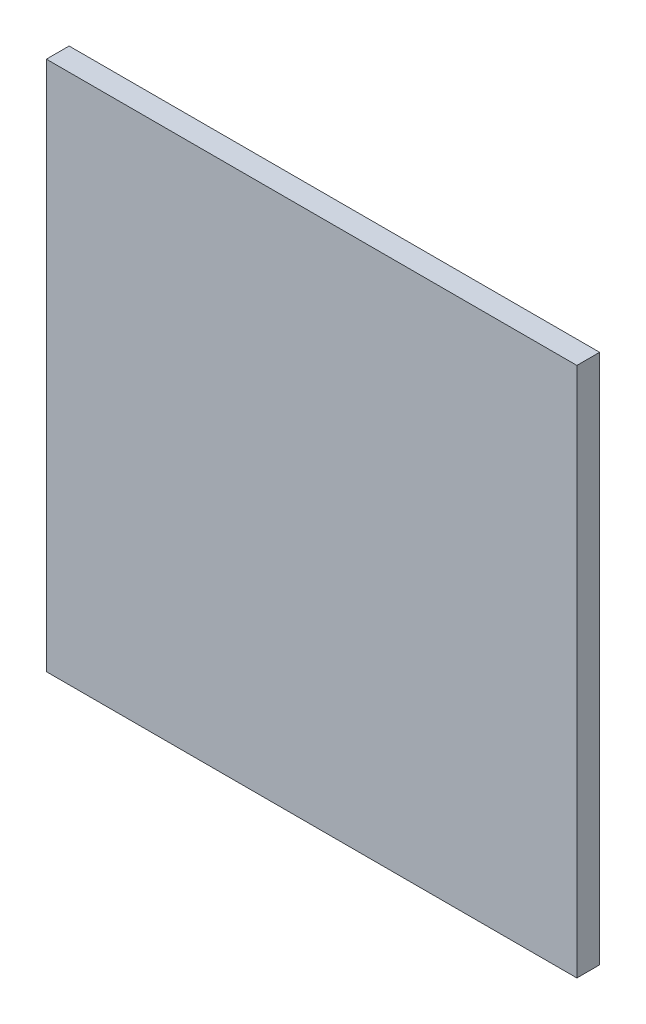
ISO-10303-21;
HEADER;
FILE_DESCRIPTION(('STEP AP214'),'2;1');
FILE_NAME('part.step','',(''),(''),'','','');
FILE_SCHEMA(('AUTOMOTIVE_DESIGN { 1 0 10303 214 1 1 1 1 }'));
ENDSEC;
DATA;
#1=APPLICATION_CONTEXT('core data for automotive mechanical design processes');
#2=APPLICATION_PROTOCOL_DEFINITION('international standard','automotive_design',2000,#1);
#3=PRODUCT_CONTEXT('',#1,'mechanical');
#4=PRODUCT('Part','Part','',(#3));
#5=PRODUCT_RELATED_PRODUCT_CATEGORY('part','',(#4));
#6=PRODUCT_DEFINITION_FORMATION('','',#4);
#7=PRODUCT_DEFINITION_CONTEXT('part definition',#1,'design');
#8=PRODUCT_DEFINITION('design','',#6,#7);
#9=PRODUCT_DEFINITION_SHAPE('','',#8);
#10=(LENGTH_UNIT() NAMED_UNIT(*) SI_UNIT(.MILLI.,.METRE.));
#11=(NAMED_UNIT(*) PLANE_ANGLE_UNIT() SI_UNIT($,.RADIAN.));
#12=(NAMED_UNIT(*) SI_UNIT($,.STERADIAN.) SOLID_ANGLE_UNIT());
#13=UNCERTAINTY_MEASURE_WITH_UNIT(LENGTH_MEASURE(1.E-05),#10,'distance_accuracy_value','');
#14=(GEOMETRIC_REPRESENTATION_CONTEXT(3) GLOBAL_UNCERTAINTY_ASSIGNED_CONTEXT((#13)) GLOBAL_UNIT_ASSIGNED_CONTEXT((#10,
#11,#12)) REPRESENTATION_CONTEXT('',''));
#15=CARTESIAN_POINT('',(0.,0.,0.));
#16=DIRECTION('',(0.,0.,1.));
#17=DIRECTION('',(1.,0.,0.));
#18=AXIS2_PLACEMENT_3D('',#15,#16,#17);
#19=CARTESIAN_POINT('',(0.65008,10.55,0.));
#20=DIRECTION('',(0.,0.,-1.));
#21=DIRECTION('',(-1.,0.,0.));
#22=AXIS2_PLACEMENT_3D('',#19,#20,#21);
#23=PLANE('',#22);
#24=DIRECTION('',(1.,0.,0.));
#25=VECTOR('',#24,1.);
#26=CARTESIAN_POINT('',(0.25008,10.95,0.));
#27=LINE('',#26,#25);
#28=CARTESIAN_POINT('',(0.25008,10.95,0.));
#29=VERTEX_POINT('',#28);
#30=CARTESIAN_POINT('',(1.05008,10.95,0.));
#31=VERTEX_POINT('',#30);
#32=EDGE_CURVE('E55',#29,#31,#27,.T.);
#33=ORIENTED_EDGE('',*,*,#32,.T.);
#34=DIRECTION('',(0.,1.,0.));
#35=VECTOR('',#34,1.);
#36=CARTESIAN_POINT('',(1.05008,10.95,0.));
#37=LINE('',#36,#35);
#38=CARTESIAN_POINT('',(1.05008,10.15,0.));
#39=VERTEX_POINT('',#38);
#40=EDGE_CURVE('E57',#31,#39,#37,.F.);
#41=ORIENTED_EDGE('',*,*,#40,.T.);
#42=DIRECTION('',(1.,0.,0.));
#43=VECTOR('',#42,1.);
#44=CARTESIAN_POINT('',(1.05008,10.15,0.));
#45=LINE('',#44,#43);
#46=CARTESIAN_POINT('',(0.25008,10.15,0.));
#47=VERTEX_POINT('',#46);
#48=EDGE_CURVE('E20',#39,#47,#45,.F.);
#49=ORIENTED_EDGE('',*,*,#48,.T.);
#50=DIRECTION('',(0.,1.,0.));
#51=VECTOR('',#50,1.);
#52=CARTESIAN_POINT('',(0.25008,10.15,0.));
#53=LINE('',#52,#51);
#54=EDGE_CURVE('E80',#47,#29,#53,.T.);
#55=ORIENTED_EDGE('',*,*,#54,.T.);
#56=EDGE_LOOP('',(#33,#41,#49,#55));
#57=FACE_BOUND('',#56,.T.);
#58=ADVANCED_FACE('F17',(#57),#23,.T.);
#59=CARTESIAN_POINT('',(1.05008,10.15,0.));
#60=DIRECTION('',(0.,1.,0.));
#61=DIRECTION('',(0.,0.,1.));
#62=AXIS2_PLACEMENT_3D('',#59,#60,#61);
#63=PLANE('',#62);
#64=DIRECTION('',(0.,0.,-1.));
#65=VECTOR('',#64,1.);
#66=CARTESIAN_POINT('',(0.25008,10.15,0.));
#67=LINE('',#66,#65);
#68=CARTESIAN_POINT('',(0.25008,10.15,0.03429));
#69=VERTEX_POINT('',#68);
#70=EDGE_CURVE('E68',#69,#47,#67,.T.);
#71=ORIENTED_EDGE('',*,*,#70,.T.);
#72=ORIENTED_EDGE('',*,*,#48,.F.);
#73=DIRECTION('',(0.,0.,1.));
#74=VECTOR('',#73,1.);
#75=CARTESIAN_POINT('',(1.05008,10.15,0.));
#76=LINE('',#75,#74);
#77=CARTESIAN_POINT('',(1.05008,10.15,0.03429));
#78=VERTEX_POINT('',#77);
#79=EDGE_CURVE('E63',#39,#78,#76,.T.);
#80=ORIENTED_EDGE('',*,*,#79,.T.);
#81=DIRECTION('',(1.,0.,0.));
#82=VECTOR('',#81,1.);
#83=CARTESIAN_POINT('',(0.65008,10.15,0.03429));
#84=LINE('',#83,#82);
#85=EDGE_CURVE('E83',#69,#78,#84,.T.);
#86=ORIENTED_EDGE('',*,*,#85,.F.);
#87=EDGE_LOOP('',(#71,#72,#80,#86));
#88=FACE_BOUND('',#87,.T.);
#89=ADVANCED_FACE('F65',(#88),#63,.F.);
#90=CARTESIAN_POINT('',(1.05008,10.95,0.));
#91=DIRECTION('',(-1.,0.,0.));
#92=DIRECTION('',(0.,0.,1.));
#93=AXIS2_PLACEMENT_3D('',#90,#91,#92);
#94=PLANE('',#93);
#95=ORIENTED_EDGE('',*,*,#79,.F.);
#96=ORIENTED_EDGE('',*,*,#40,.F.);
#97=DIRECTION('',(0.,0.,-1.));
#98=VECTOR('',#97,1.);
#99=CARTESIAN_POINT('',(1.05008,10.95,0.));
#100=LINE('',#99,#98);
#101=CARTESIAN_POINT('',(1.05008,10.95,0.03429));
#102=VERTEX_POINT('',#101);
#103=EDGE_CURVE('E75',#31,#102,#100,.F.);
#104=ORIENTED_EDGE('',*,*,#103,.T.);
#105=DIRECTION('',(0.,1.,0.));
#106=VECTOR('',#105,1.);
#107=CARTESIAN_POINT('',(1.05008,10.55,0.03429));
#108=LINE('',#107,#106);
#109=EDGE_CURVE('E72',#78,#102,#108,.T.);
#110=ORIENTED_EDGE('',*,*,#109,.F.);
#111=EDGE_LOOP('',(#95,#96,#104,#110));
#112=FACE_BOUND('',#111,.T.);
#113=ADVANCED_FACE('F70',(#112),#94,.F.);
#114=CARTESIAN_POINT('',(0.25008,10.95,0.));
#115=DIRECTION('',(0.,-1.,0.));
#116=DIRECTION('',(0.,0.,-1.));
#117=AXIS2_PLACEMENT_3D('',#114,#115,#116);
#118=PLANE('',#117);
#119=ORIENTED_EDGE('',*,*,#103,.F.);
#120=ORIENTED_EDGE('',*,*,#32,.F.);
#121=DIRECTION('',(0.,0.,-1.));
#122=VECTOR('',#121,1.);
#123=CARTESIAN_POINT('',(0.25008,10.95,0.));
#124=LINE('',#123,#122);
#125=CARTESIAN_POINT('',(0.25008,10.95,0.03429));
#126=VERTEX_POINT('',#125);
#127=EDGE_CURVE('E35',#29,#126,#124,.F.);
#128=ORIENTED_EDGE('',*,*,#127,.T.);
#129=DIRECTION('',(1.,0.,0.));
#130=VECTOR('',#129,1.);
#131=CARTESIAN_POINT('',(0.65008,10.95,0.03429));
#132=LINE('',#131,#130);
#133=EDGE_CURVE('E26',#102,#126,#132,.F.);
#134=ORIENTED_EDGE('',*,*,#133,.F.);
#135=EDGE_LOOP('',(#119,#120,#128,#134));
#136=FACE_BOUND('',#135,.T.);
#137=ADVANCED_FACE('F89',(#136),#118,.F.);
#138=CARTESIAN_POINT('',(0.25008,10.15,0.));
#139=DIRECTION('',(1.,0.,0.));
#140=DIRECTION('',(0.,0.,-1.));
#141=AXIS2_PLACEMENT_3D('',#138,#139,#140);
#142=PLANE('',#141);
#143=ORIENTED_EDGE('',*,*,#127,.F.);
#144=ORIENTED_EDGE('',*,*,#54,.F.);
#145=ORIENTED_EDGE('',*,*,#70,.F.);
#146=DIRECTION('',(0.,1.,0.));
#147=VECTOR('',#146,1.);
#148=CARTESIAN_POINT('',(0.25008,10.55,0.03429));
#149=LINE('',#148,#147);
#150=EDGE_CURVE('E11',#126,#69,#149,.F.);
#151=ORIENTED_EDGE('',*,*,#150,.F.);
#152=EDGE_LOOP('',(#143,#144,#145,#151));
#153=FACE_BOUND('',#152,.T.);
#154=ADVANCED_FACE('F91',(#153),#142,.F.);
#155=CARTESIAN_POINT('',(0.65008,10.55,0.03429));
#156=DIRECTION('',(0.,0.,1.));
#157=DIRECTION('',(1.,0.,0.));
#158=AXIS2_PLACEMENT_3D('',#155,#156,#157);
#159=PLANE('',#158);
#160=ORIENTED_EDGE('',*,*,#133,.T.);
#161=ORIENTED_EDGE('',*,*,#150,.T.);
#162=ORIENTED_EDGE('',*,*,#85,.T.);
#163=ORIENTED_EDGE('',*,*,#109,.T.);
#164=EDGE_LOOP('',(#160,#161,#162,#163));
#165=FACE_BOUND('',#164,.T.);
#166=ADVANCED_FACE('F88',(#165),#159,.T.);
#167=CLOSED_SHELL('',(#58,#89,#113,#137,#154,#166));
#168=MANIFOLD_SOLID_BREP('B1',#167);
#169=ADVANCED_BREP_SHAPE_REPRESENTATION('',(#18,#168),#14);
#170=SHAPE_DEFINITION_REPRESENTATION(#9,#169);
ENDSEC;
END-ISO-10303-21;
